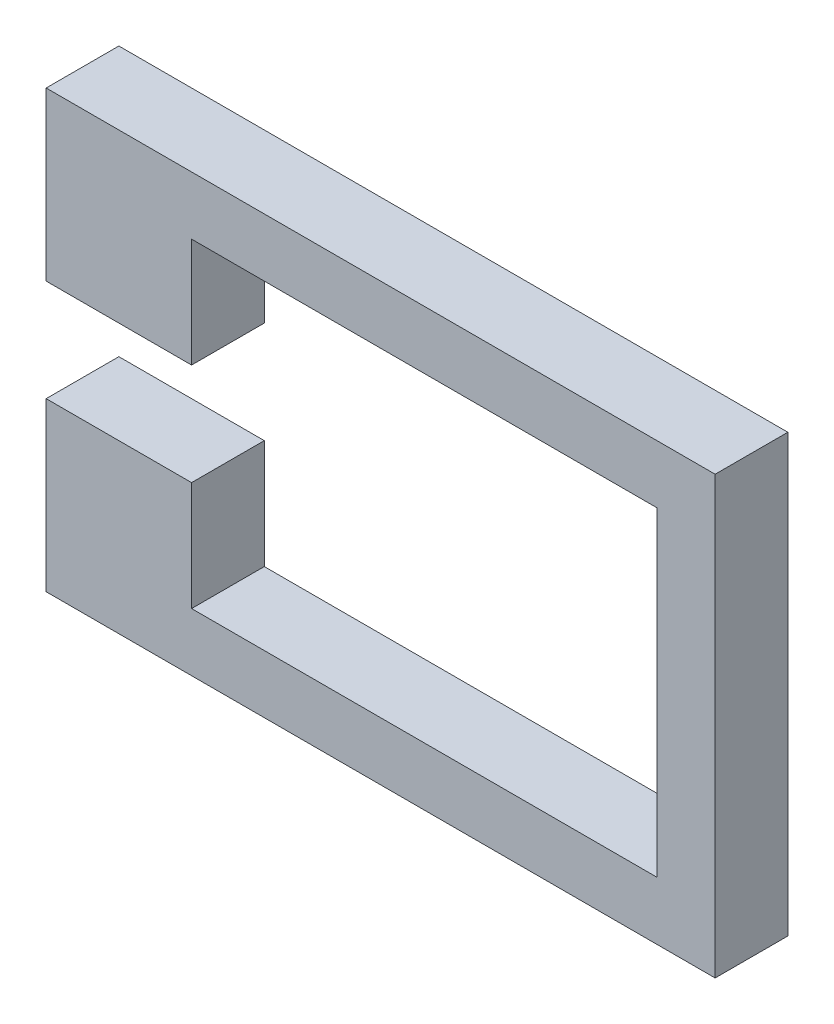
ISO-10303-21;
HEADER;
FILE_DESCRIPTION(('STEP AP214'),'2;1');
FILE_NAME('part.step','',(''),(''),'','','');
FILE_SCHEMA(('AUTOMOTIVE_DESIGN { 1 0 10303 214 1 1 1 1 }'));
ENDSEC;
DATA;
#1=APPLICATION_CONTEXT('core data for automotive mechanical design processes');
#2=APPLICATION_PROTOCOL_DEFINITION('international standard','automotive_design',2000,#1);
#3=PRODUCT_CONTEXT('',#1,'mechanical');
#4=PRODUCT('Part','Part','',(#3));
#5=PRODUCT_RELATED_PRODUCT_CATEGORY('part','',(#4));
#6=PRODUCT_DEFINITION_FORMATION('','',#4);
#7=PRODUCT_DEFINITION_CONTEXT('part definition',#1,'design');
#8=PRODUCT_DEFINITION('design','',#6,#7);
#9=PRODUCT_DEFINITION_SHAPE('','',#8);
#10=(LENGTH_UNIT() NAMED_UNIT(*) SI_UNIT(.MILLI.,.METRE.));
#11=(NAMED_UNIT(*) PLANE_ANGLE_UNIT() SI_UNIT($,.RADIAN.));
#12=(NAMED_UNIT(*) SI_UNIT($,.STERADIAN.) SOLID_ANGLE_UNIT());
#13=UNCERTAINTY_MEASURE_WITH_UNIT(LENGTH_MEASURE(1.E-05),#10,'distance_accuracy_value','');
#14=(GEOMETRIC_REPRESENTATION_CONTEXT(3) GLOBAL_UNCERTAINTY_ASSIGNED_CONTEXT((#13)) GLOBAL_UNIT_ASSIGNED_CONTEXT((#10,
#11,#12)) REPRESENTATION_CONTEXT('',''));
#15=CARTESIAN_POINT('',(0.,0.,0.));
#16=DIRECTION('',(0.,0.,1.));
#17=DIRECTION('',(1.,0.,0.));
#18=AXIS2_PLACEMENT_3D('',#15,#16,#17);
#19=CARTESIAN_POINT('',(-26.67,-8.25500000000001,6.35));
#20=DIRECTION('',(1.,0.,0.));
#21=DIRECTION('',(0.,1.,0.));
#22=AXIS2_PLACEMENT_3D('',#19,#20,#21);
#23=PLANE('',#22);
#24=DIRECTION('',(0.,-1.,0.));
#25=VECTOR('',#24,1.);
#26=CARTESIAN_POINT('',(-26.67,-8.25500000000001,0.));
#27=LINE('',#26,#25);
#28=CARTESIAN_POINT('',(-26.67,6.34999999999999,0.));
#29=VERTEX_POINT('',#28);
#30=CARTESIAN_POINT('',(-26.67,-8.25500000000001,0.));
#31=VERTEX_POINT('',#30);
#32=EDGE_CURVE('E154',#29,#31,#27,.T.);
#33=ORIENTED_EDGE('',*,*,#32,.T.);
#34=DIRECTION('',(0.,0.,-1.));
#35=VECTOR('',#34,1.);
#36=CARTESIAN_POINT('',(-26.67,-8.25500000000001,6.35));
#37=LINE('',#36,#35);
#38=CARTESIAN_POINT('',(-26.67,-8.25500000000001,6.35));
#39=VERTEX_POINT('',#38);
#40=EDGE_CURVE('E11',#39,#31,#37,.T.);
#41=ORIENTED_EDGE('',*,*,#40,.F.);
#42=DIRECTION('',(0.,-1.,0.));
#43=VECTOR('',#42,1.);
#44=CARTESIAN_POINT('',(-26.67,-8.25500000000001,6.35));
#45=LINE('',#44,#43);
#46=CARTESIAN_POINT('',(-26.67,6.34999999999999,6.35));
#47=VERTEX_POINT('',#46);
#48=EDGE_CURVE('E176',#47,#39,#45,.T.);
#49=ORIENTED_EDGE('',*,*,#48,.F.);
#50=DIRECTION('',(0.,0.,-1.));
#51=VECTOR('',#50,1.);
#52=CARTESIAN_POINT('',(-26.67,6.34999999999999,6.35));
#53=LINE('',#52,#51);
#54=EDGE_CURVE('E150',#47,#29,#53,.T.);
#55=ORIENTED_EDGE('',*,*,#54,.T.);
#56=EDGE_LOOP('',(#33,#41,#49,#55));
#57=FACE_BOUND('',#56,.T.);
#58=ADVANCED_FACE('F34',(#57),#23,.F.);
#59=CARTESIAN_POINT('',(-13.97,-8.25500000000001,6.35));
#60=DIRECTION('',(0.,1.,0.));
#61=DIRECTION('',(0.,0.,1.));
#62=AXIS2_PLACEMENT_3D('',#59,#60,#61);
#63=PLANE('',#62);
#64=DIRECTION('',(1.,0.,0.));
#65=VECTOR('',#64,1.);
#66=CARTESIAN_POINT('',(-13.97,-8.25500000000001,0.));
#67=LINE('',#66,#65);
#68=CARTESIAN_POINT('',(-13.97,-8.25500000000001,0.));
#69=VERTEX_POINT('',#68);
#70=EDGE_CURVE('E157',#31,#69,#67,.T.);
#71=ORIENTED_EDGE('',*,*,#70,.T.);
#72=DIRECTION('',(0.,0.,-1.));
#73=VECTOR('',#72,1.);
#74=CARTESIAN_POINT('',(-13.97,-8.25500000000001,6.35));
#75=LINE('',#74,#73);
#76=CARTESIAN_POINT('',(-13.97,-8.25500000000001,6.35));
#77=VERTEX_POINT('',#76);
#78=EDGE_CURVE('E42',#77,#69,#75,.T.);
#79=ORIENTED_EDGE('',*,*,#78,.F.);
#80=DIRECTION('',(1.,0.,0.));
#81=VECTOR('',#80,1.);
#82=CARTESIAN_POINT('',(-13.97,-8.25500000000001,6.35));
#83=LINE('',#82,#81);
#84=EDGE_CURVE('E105',#39,#77,#83,.T.);
#85=ORIENTED_EDGE('',*,*,#84,.F.);
#86=ORIENTED_EDGE('',*,*,#40,.T.);
#87=EDGE_LOOP('',(#71,#79,#85,#86));
#88=FACE_BOUND('',#87,.T.);
#89=ADVANCED_FACE('F254',(#88),#63,.F.);
#90=CARTESIAN_POINT('',(-13.97,-8.25500000000001,6.35));
#91=DIRECTION('',(-1.,0.,0.));
#92=DIRECTION('',(0.,0.,1.));
#93=AXIS2_PLACEMENT_3D('',#90,#91,#92);
#94=PLANE('',#93);
#95=DIRECTION('',(0.,1.,0.));
#96=VECTOR('',#95,1.);
#97=CARTESIAN_POINT('',(-13.97,-8.25500000000001,0.));
#98=LINE('',#97,#96);
#99=CARTESIAN_POINT('',(-13.97,1.26999999999999,0.));
#100=VERTEX_POINT('',#99);
#101=EDGE_CURVE('E159',#69,#100,#98,.T.);
#102=ORIENTED_EDGE('',*,*,#101,.T.);
#103=DIRECTION('',(0.,0.,-1.));
#104=VECTOR('',#103,1.);
#105=CARTESIAN_POINT('',(-13.97,1.26999999999999,6.35));
#106=LINE('',#105,#104);
#107=CARTESIAN_POINT('',(-13.97,1.26999999999999,6.35));
#108=VERTEX_POINT('',#107);
#109=EDGE_CURVE('E195',#108,#100,#106,.T.);
#110=ORIENTED_EDGE('',*,*,#109,.F.);
#111=DIRECTION('',(0.,1.,0.));
#112=VECTOR('',#111,1.);
#113=CARTESIAN_POINT('',(-13.97,-8.25500000000001,6.35));
#114=LINE('',#113,#112);
#115=EDGE_CURVE('E203',#77,#108,#114,.T.);
#116=ORIENTED_EDGE('',*,*,#115,.F.);
#117=ORIENTED_EDGE('',*,*,#78,.T.);
#118=EDGE_LOOP('',(#102,#110,#116,#117));
#119=FACE_BOUND('',#118,.T.);
#120=ADVANCED_FACE('F201',(#119),#94,.F.);
#121=CARTESIAN_POINT('',(26.67,1.26999999999999,6.35));
#122=DIRECTION('',(0.,1.,0.));
#123=DIRECTION('',(-1.,0.,0.));
#124=AXIS2_PLACEMENT_3D('',#121,#122,#123);
#125=PLANE('',#124);
#126=DIRECTION('',(1.,0.,0.));
#127=VECTOR('',#126,1.);
#128=CARTESIAN_POINT('',(26.67,1.26999999999999,0.));
#129=LINE('',#128,#127);
#130=CARTESIAN_POINT('',(26.67,1.26999999999999,0.));
#131=VERTEX_POINT('',#130);
#132=EDGE_CURVE('E161',#100,#131,#129,.T.);
#133=ORIENTED_EDGE('',*,*,#132,.T.);
#134=DIRECTION('',(0.,0.,-1.));
#135=VECTOR('',#134,1.);
#136=CARTESIAN_POINT('',(26.67,1.26999999999999,6.35));
#137=LINE('',#136,#135);
#138=CARTESIAN_POINT('',(26.67,1.26999999999999,6.35));
#139=VERTEX_POINT('',#138);
#140=EDGE_CURVE('E192',#139,#131,#137,.T.);
#141=ORIENTED_EDGE('',*,*,#140,.F.);
#142=DIRECTION('',(1.,0.,0.));
#143=VECTOR('',#142,1.);
#144=CARTESIAN_POINT('',(26.67,1.26999999999999,6.35));
#145=LINE('',#144,#143);
#146=EDGE_CURVE('E221',#108,#139,#145,.T.);
#147=ORIENTED_EDGE('',*,*,#146,.F.);
#148=ORIENTED_EDGE('',*,*,#109,.T.);
#149=EDGE_LOOP('',(#133,#141,#147,#148));
#150=FACE_BOUND('',#149,.T.);
#151=ADVANCED_FACE('F212',(#150),#125,.F.);
#152=CARTESIAN_POINT('',(26.67,-26.67,6.35));
#153=DIRECTION('',(1.,0.,0.));
#154=DIRECTION('',(0.,0.,-1.));
#155=AXIS2_PLACEMENT_3D('',#152,#153,#154);
#156=PLANE('',#155);
#157=DIRECTION('',(0.,-1.,0.));
#158=VECTOR('',#157,1.);
#159=CARTESIAN_POINT('',(26.67,-26.67,0.));
#160=LINE('',#159,#158);
#161=CARTESIAN_POINT('',(26.67,-26.67,0.));
#162=VERTEX_POINT('',#161);
#163=EDGE_CURVE('E163',#131,#162,#160,.T.);
#164=ORIENTED_EDGE('',*,*,#163,.T.);
#165=DIRECTION('',(0.,0.,-1.));
#166=VECTOR('',#165,1.);
#167=CARTESIAN_POINT('',(26.67,-26.67,6.35));
#168=LINE('',#167,#166);
#169=CARTESIAN_POINT('',(26.67,-26.67,6.35));
#170=VERTEX_POINT('',#169);
#171=EDGE_CURVE('E189',#170,#162,#168,.T.);
#172=ORIENTED_EDGE('',*,*,#171,.F.);
#173=DIRECTION('',(0.,-1.,0.));
#174=VECTOR('',#173,1.);
#175=CARTESIAN_POINT('',(26.67,-26.67,6.35));
#176=LINE('',#175,#174);
#177=EDGE_CURVE('E218',#139,#170,#176,.T.);
#178=ORIENTED_EDGE('',*,*,#177,.F.);
#179=ORIENTED_EDGE('',*,*,#140,.T.);
#180=EDGE_LOOP('',(#164,#172,#178,#179));
#181=FACE_BOUND('',#180,.T.);
#182=ADVANCED_FACE('F216',(#181),#156,.F.);
#183=CARTESIAN_POINT('',(26.67,-26.67,6.35));
#184=DIRECTION('',(0.,-1.,0.));
#185=DIRECTION('',(1.,0.,0.));
#186=AXIS2_PLACEMENT_3D('',#183,#184,#185);
#187=PLANE('',#186);
#188=DIRECTION('',(-1.,0.,0.));
#189=VECTOR('',#188,1.);
#190=CARTESIAN_POINT('',(26.67,-26.67,0.));
#191=LINE('',#190,#189);
#192=CARTESIAN_POINT('',(-13.97,-26.67,0.));
#193=VERTEX_POINT('',#192);
#194=EDGE_CURVE('E165',#162,#193,#191,.T.);
#195=ORIENTED_EDGE('',*,*,#194,.T.);
#196=DIRECTION('',(0.,0.,-1.));
#197=VECTOR('',#196,1.);
#198=CARTESIAN_POINT('',(-13.97,-26.67,6.35));
#199=LINE('',#198,#197);
#200=CARTESIAN_POINT('',(-13.97,-26.67,6.35));
#201=VERTEX_POINT('',#200);
#202=EDGE_CURVE('E186',#201,#193,#199,.T.);
#203=ORIENTED_EDGE('',*,*,#202,.F.);
#204=DIRECTION('',(-1.,0.,0.));
#205=VECTOR('',#204,1.);
#206=CARTESIAN_POINT('',(26.67,-26.67,6.35));
#207=LINE('',#206,#205);
#208=EDGE_CURVE('E220',#170,#201,#207,.T.);
#209=ORIENTED_EDGE('',*,*,#208,.F.);
#210=ORIENTED_EDGE('',*,*,#171,.T.);
#211=EDGE_LOOP('',(#195,#203,#209,#210));
#212=FACE_BOUND('',#211,.T.);
#213=ADVANCED_FACE('F267',(#212),#187,.F.);
#214=CARTESIAN_POINT('',(-13.97,-26.67,6.35));
#215=DIRECTION('',(-1.,0.,0.));
#216=DIRECTION('',(0.,0.,1.));
#217=AXIS2_PLACEMENT_3D('',#214,#215,#216);
#218=PLANE('',#217);
#219=DIRECTION('',(0.,1.,0.));
#220=VECTOR('',#219,1.);
#221=CARTESIAN_POINT('',(-13.97,-26.67,0.));
#222=LINE('',#221,#220);
#223=CARTESIAN_POINT('',(-13.97,-17.145,0.));
#224=VERTEX_POINT('',#223);
#225=EDGE_CURVE('E167',#193,#224,#222,.T.);
#226=ORIENTED_EDGE('',*,*,#225,.T.);
#227=DIRECTION('',(0.,0.,-1.));
#228=VECTOR('',#227,1.);
#229=CARTESIAN_POINT('',(-13.97,-17.145,6.35));
#230=LINE('',#229,#228);
#231=CARTESIAN_POINT('',(-13.97,-17.145,6.35));
#232=VERTEX_POINT('',#231);
#233=EDGE_CURVE('E183',#232,#224,#230,.T.);
#234=ORIENTED_EDGE('',*,*,#233,.F.);
#235=DIRECTION('',(0.,1.,0.));
#236=VECTOR('',#235,1.);
#237=CARTESIAN_POINT('',(-13.97,-26.67,6.35));
#238=LINE('',#237,#236);
#239=EDGE_CURVE('E223',#201,#232,#238,.T.);
#240=ORIENTED_EDGE('',*,*,#239,.F.);
#241=ORIENTED_EDGE('',*,*,#202,.T.);
#242=EDGE_LOOP('',(#226,#234,#240,#241));
#243=FACE_BOUND('',#242,.T.);
#244=ADVANCED_FACE('F270',(#243),#218,.F.);
#245=CARTESIAN_POINT('',(-13.97,-17.145,6.35));
#246=DIRECTION('',(0.,-1.,0.));
#247=DIRECTION('',(0.,0.,-1.));
#248=AXIS2_PLACEMENT_3D('',#245,#246,#247);
#249=PLANE('',#248);
#250=DIRECTION('',(-1.,0.,0.));
#251=VECTOR('',#250,1.);
#252=CARTESIAN_POINT('',(-13.97,-17.145,0.));
#253=LINE('',#252,#251);
#254=CARTESIAN_POINT('',(-26.67,-17.145,0.));
#255=VERTEX_POINT('',#254);
#256=EDGE_CURVE('E169',#224,#255,#253,.T.);
#257=ORIENTED_EDGE('',*,*,#256,.T.);
#258=DIRECTION('',(0.,0.,-1.));
#259=VECTOR('',#258,1.);
#260=CARTESIAN_POINT('',(-26.67,-17.145,6.35));
#261=LINE('',#260,#259);
#262=CARTESIAN_POINT('',(-26.67,-17.145,6.35));
#263=VERTEX_POINT('',#262);
#264=EDGE_CURVE('E180',#263,#255,#261,.T.);
#265=ORIENTED_EDGE('',*,*,#264,.F.);
#266=DIRECTION('',(-1.,0.,0.));
#267=VECTOR('',#266,1.);
#268=CARTESIAN_POINT('',(-13.97,-17.145,6.35));
#269=LINE('',#268,#267);
#270=EDGE_CURVE('E229',#232,#263,#269,.T.);
#271=ORIENTED_EDGE('',*,*,#270,.F.);
#272=ORIENTED_EDGE('',*,*,#233,.T.);
#273=EDGE_LOOP('',(#257,#265,#271,#272));
#274=FACE_BOUND('',#273,.T.);
#275=ADVANCED_FACE('F235',(#274),#249,.F.);
#276=CARTESIAN_POINT('',(-26.67,-31.75,6.35));
#277=DIRECTION('',(1.,0.,0.));
#278=DIRECTION('',(0.,1.,0.));
#279=AXIS2_PLACEMENT_3D('',#276,#277,#278);
#280=PLANE('',#279);
#281=DIRECTION('',(0.,-1.,0.));
#282=VECTOR('',#281,1.);
#283=CARTESIAN_POINT('',(-26.67,-31.75,0.));
#284=LINE('',#283,#282);
#285=CARTESIAN_POINT('',(-26.67,-31.75,0.));
#286=VERTEX_POINT('',#285);
#287=EDGE_CURVE('E171',#255,#286,#284,.T.);
#288=ORIENTED_EDGE('',*,*,#287,.T.);
#289=DIRECTION('',(0.,0.,-1.));
#290=VECTOR('',#289,1.);
#291=CARTESIAN_POINT('',(-26.67,-31.75,6.35));
#292=LINE('',#291,#290);
#293=CARTESIAN_POINT('',(-26.67,-31.75,6.35));
#294=VERTEX_POINT('',#293);
#295=EDGE_CURVE('E145',#294,#286,#292,.T.);
#296=ORIENTED_EDGE('',*,*,#295,.F.);
#297=DIRECTION('',(0.,-1.,0.));
#298=VECTOR('',#297,1.);
#299=CARTESIAN_POINT('',(-26.67,-31.75,6.35));
#300=LINE('',#299,#298);
#301=EDGE_CURVE('E136',#263,#294,#300,.T.);
#302=ORIENTED_EDGE('',*,*,#301,.F.);
#303=ORIENTED_EDGE('',*,*,#264,.T.);
#304=EDGE_LOOP('',(#288,#296,#302,#303));
#305=FACE_BOUND('',#304,.T.);
#306=ADVANCED_FACE('F239',(#305),#280,.F.);
#307=CARTESIAN_POINT('',(31.75,-31.75,6.35));
#308=DIRECTION('',(0.,1.,0.));
#309=DIRECTION('',(-1.,0.,0.));
#310=AXIS2_PLACEMENT_3D('',#307,#308,#309);
#311=PLANE('',#310);
#312=DIRECTION('',(1.,0.,0.));
#313=VECTOR('',#312,1.);
#314=CARTESIAN_POINT('',(31.75,-31.75,0.));
#315=LINE('',#314,#313);
#316=CARTESIAN_POINT('',(31.75,-31.75,0.));
#317=VERTEX_POINT('',#316);
#318=EDGE_CURVE('E144',#286,#317,#315,.T.);
#319=ORIENTED_EDGE('',*,*,#318,.T.);
#320=DIRECTION('',(0.,0.,-1.));
#321=VECTOR('',#320,1.);
#322=CARTESIAN_POINT('',(31.75,-31.75,6.35));
#323=LINE('',#322,#321);
#324=CARTESIAN_POINT('',(31.75,-31.75,6.35));
#325=VERTEX_POINT('',#324);
#326=EDGE_CURVE('E141',#325,#317,#323,.T.);
#327=ORIENTED_EDGE('',*,*,#326,.F.);
#328=DIRECTION('',(1.,0.,0.));
#329=VECTOR('',#328,1.);
#330=CARTESIAN_POINT('',(31.75,-31.75,6.35));
#331=LINE('',#330,#329);
#332=EDGE_CURVE('E130',#294,#325,#331,.T.);
#333=ORIENTED_EDGE('',*,*,#332,.F.);
#334=ORIENTED_EDGE('',*,*,#295,.T.);
#335=EDGE_LOOP('',(#319,#327,#333,#334));
#336=FACE_BOUND('',#335,.T.);
#337=ADVANCED_FACE('F142',(#336),#311,.F.);
#338=CARTESIAN_POINT('',(31.75,-31.75,6.35));
#339=DIRECTION('',(-1.,0.,0.));
#340=DIRECTION('',(0.,0.,1.));
#341=AXIS2_PLACEMENT_3D('',#338,#339,#340);
#342=PLANE('',#341);
#343=DIRECTION('',(0.,1.,0.));
#344=VECTOR('',#343,1.);
#345=CARTESIAN_POINT('',(31.75,-31.75,0.));
#346=LINE('',#345,#344);
#347=CARTESIAN_POINT('',(31.75,6.34999999999999,0.));
#348=VERTEX_POINT('',#347);
#349=EDGE_CURVE('E91',#317,#348,#346,.T.);
#350=ORIENTED_EDGE('',*,*,#349,.T.);
#351=DIRECTION('',(0.,0.,-1.));
#352=VECTOR('',#351,1.);
#353=CARTESIAN_POINT('',(31.75,6.34999999999999,6.35));
#354=LINE('',#353,#352);
#355=CARTESIAN_POINT('',(31.75,6.34999999999999,6.35));
#356=VERTEX_POINT('',#355);
#357=EDGE_CURVE('E146',#356,#348,#354,.T.);
#358=ORIENTED_EDGE('',*,*,#357,.F.);
#359=DIRECTION('',(0.,1.,0.));
#360=VECTOR('',#359,1.);
#361=CARTESIAN_POINT('',(31.75,-31.75,6.35));
#362=LINE('',#361,#360);
#363=EDGE_CURVE('E134',#325,#356,#362,.T.);
#364=ORIENTED_EDGE('',*,*,#363,.F.);
#365=ORIENTED_EDGE('',*,*,#326,.T.);
#366=EDGE_LOOP('',(#350,#358,#364,#365));
#367=FACE_BOUND('',#366,.T.);
#368=ADVANCED_FACE('F148',(#367),#342,.F.);
#369=CARTESIAN_POINT('',(31.75,6.34999999999999,6.35));
#370=DIRECTION('',(0.,-1.,0.));
#371=DIRECTION('',(0.,0.,-1.));
#372=AXIS2_PLACEMENT_3D('',#369,#370,#371);
#373=PLANE('',#372);
#374=DIRECTION('',(-1.,0.,0.));
#375=VECTOR('',#374,1.);
#376=CARTESIAN_POINT('',(31.75,6.34999999999999,0.));
#377=LINE('',#376,#375);
#378=EDGE_CURVE('E97',#348,#29,#377,.T.);
#379=ORIENTED_EDGE('',*,*,#378,.T.);
#380=ORIENTED_EDGE('',*,*,#54,.F.);
#381=DIRECTION('',(-1.,0.,0.));
#382=VECTOR('',#381,1.);
#383=CARTESIAN_POINT('',(31.75,6.34999999999999,6.35));
#384=LINE('',#383,#382);
#385=EDGE_CURVE('E50',#356,#47,#384,.T.);
#386=ORIENTED_EDGE('',*,*,#385,.F.);
#387=ORIENTED_EDGE('',*,*,#357,.T.);
#388=EDGE_LOOP('',(#379,#380,#386,#387));
#389=FACE_BOUND('',#388,.T.);
#390=ADVANCED_FACE('F243',(#389),#373,.F.);
#391=CARTESIAN_POINT('',(0.,0.,6.35));
#392=DIRECTION('',(0.,0.,1.));
#393=DIRECTION('',(1.,0.,0.));
#394=AXIS2_PLACEMENT_3D('',#391,#392,#393);
#395=PLANE('',#394);
#396=ORIENTED_EDGE('',*,*,#48,.T.);
#397=ORIENTED_EDGE('',*,*,#84,.T.);
#398=ORIENTED_EDGE('',*,*,#115,.T.);
#399=ORIENTED_EDGE('',*,*,#146,.T.);
#400=ORIENTED_EDGE('',*,*,#177,.T.);
#401=ORIENTED_EDGE('',*,*,#208,.T.);
#402=ORIENTED_EDGE('',*,*,#239,.T.);
#403=ORIENTED_EDGE('',*,*,#270,.T.);
#404=ORIENTED_EDGE('',*,*,#301,.T.);
#405=ORIENTED_EDGE('',*,*,#332,.T.);
#406=ORIENTED_EDGE('',*,*,#363,.T.);
#407=ORIENTED_EDGE('',*,*,#385,.T.);
#408=EDGE_LOOP('',(#396,#397,#398,#399,#400,#401,#402,#403,#404,#405,#406,#407));
#409=FACE_BOUND('',#408,.T.);
#410=ADVANCED_FACE('F132',(#409),#395,.T.);
#411=CARTESIAN_POINT('',(0.,0.,0.));
#412=DIRECTION('',(0.,0.,1.));
#413=DIRECTION('',(1.,0.,0.));
#414=AXIS2_PLACEMENT_3D('',#411,#412,#413);
#415=PLANE('',#414);
#416=ORIENTED_EDGE('',*,*,#32,.F.);
#417=ORIENTED_EDGE('',*,*,#378,.F.);
#418=ORIENTED_EDGE('',*,*,#349,.F.);
#419=ORIENTED_EDGE('',*,*,#318,.F.);
#420=ORIENTED_EDGE('',*,*,#287,.F.);
#421=ORIENTED_EDGE('',*,*,#256,.F.);
#422=ORIENTED_EDGE('',*,*,#225,.F.);
#423=ORIENTED_EDGE('',*,*,#194,.F.);
#424=ORIENTED_EDGE('',*,*,#163,.F.);
#425=ORIENTED_EDGE('',*,*,#132,.F.);
#426=ORIENTED_EDGE('',*,*,#101,.F.);
#427=ORIENTED_EDGE('',*,*,#70,.F.);
#428=EDGE_LOOP('',(#416,#417,#418,#419,#420,#421,#422,#423,#424,#425,#426,#427));
#429=FACE_BOUND('',#428,.T.);
#430=ADVANCED_FACE('F207',(#429),#415,.F.);
#431=CLOSED_SHELL('',(#58,#89,#120,#151,#182,#213,#244,#275,#306,#337,#368,#390,#410,#430));
#432=MANIFOLD_SOLID_BREP('B2',#431);
#433=ADVANCED_BREP_SHAPE_REPRESENTATION('',(#18,#432),#14);
#434=SHAPE_DEFINITION_REPRESENTATION(#9,#433);
ENDSEC;
END-ISO-10303-21;
